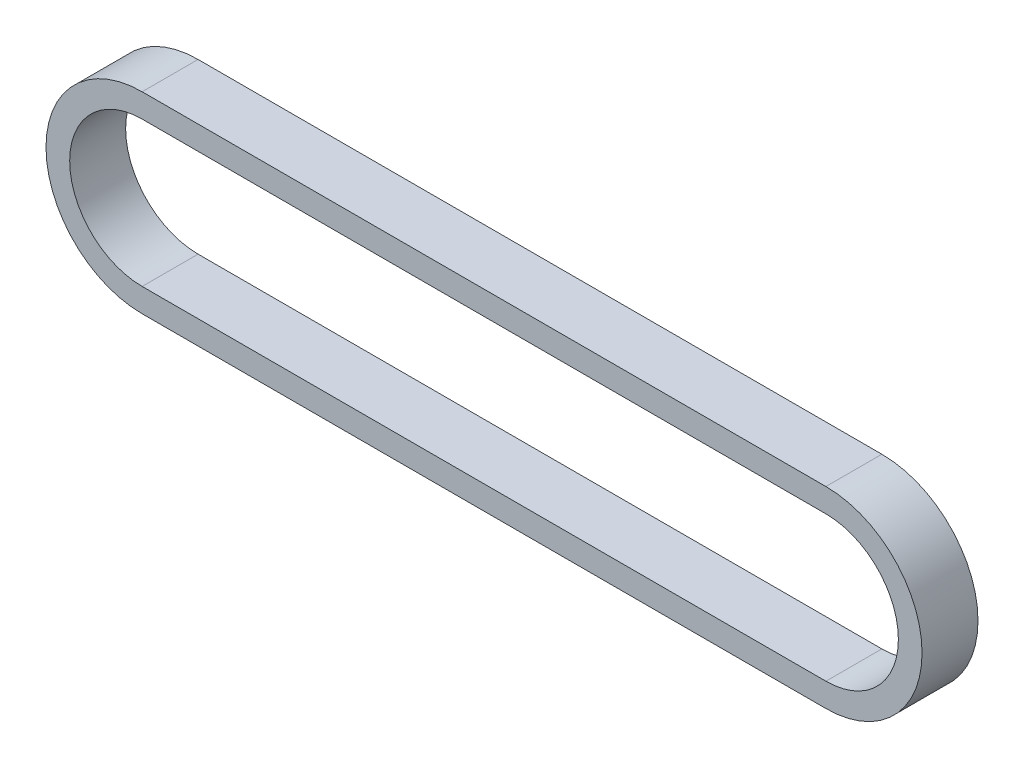
ISO-10303-21;
HEADER;
FILE_DESCRIPTION(('STEP AP214'),'2;1');
FILE_NAME('part.step','',(''),(''),'','','');
FILE_SCHEMA(('AUTOMOTIVE_DESIGN { 1 0 10303 214 1 1 1 1 }'));
ENDSEC;
DATA;
#1=APPLICATION_CONTEXT('core data for automotive mechanical design processes');
#2=APPLICATION_PROTOCOL_DEFINITION('international standard','automotive_design',2000,#1);
#3=PRODUCT_CONTEXT('',#1,'mechanical');
#4=PRODUCT('Part','Part','',(#3));
#5=PRODUCT_RELATED_PRODUCT_CATEGORY('part','',(#4));
#6=PRODUCT_DEFINITION_FORMATION('','',#4);
#7=PRODUCT_DEFINITION_CONTEXT('part definition',#1,'design');
#8=PRODUCT_DEFINITION('design','',#6,#7);
#9=PRODUCT_DEFINITION_SHAPE('','',#8);
#10=(LENGTH_UNIT() NAMED_UNIT(*) SI_UNIT(.MILLI.,.METRE.));
#11=(NAMED_UNIT(*) PLANE_ANGLE_UNIT() SI_UNIT($,.RADIAN.));
#12=(NAMED_UNIT(*) SI_UNIT($,.STERADIAN.) SOLID_ANGLE_UNIT());
#13=UNCERTAINTY_MEASURE_WITH_UNIT(LENGTH_MEASURE(1.E-05),#10,'distance_accuracy_value','');
#14=(GEOMETRIC_REPRESENTATION_CONTEXT(3) GLOBAL_UNCERTAINTY_ASSIGNED_CONTEXT((#13)) GLOBAL_UNIT_ASSIGNED_CONTEXT((#10,
#11,#12)) REPRESENTATION_CONTEXT('',''));
#15=CARTESIAN_POINT('',(0.,0.,0.));
#16=DIRECTION('',(0.,0.,1.));
#17=DIRECTION('',(1.,0.,0.));
#18=AXIS2_PLACEMENT_3D('',#15,#16,#17);
#19=CARTESIAN_POINT('',(0.,0.,4.5));
#20=DIRECTION('',(0.,0.,1.));
#21=DIRECTION('',(1.,0.,0.));
#22=AXIS2_PLACEMENT_3D('',#19,#20,#21);
#23=PLANE('',#22);
#24=CARTESIAN_POINT('',(0.,0.,4.5));
#25=DIRECTION('',(0.,0.,1.));
#26=DIRECTION('',(1.,0.,0.));
#27=AXIS2_PLACEMENT_3D('',#24,#25,#26);
#28=CIRCLE('',#27,15.4669567079091);
#29=CARTESIAN_POINT('',(0.,15.4669567079091,4.5));
#30=VERTEX_POINT('',#29);
#31=CARTESIAN_POINT('',(0.,-15.4669567079091,4.5));
#32=VERTEX_POINT('',#31);
#33=EDGE_CURVE('E157',#30,#32,#28,.T.);
#34=ORIENTED_EDGE('',*,*,#33,.T.);
#35=DIRECTION('',(1.,0.,0.));
#36=VECTOR('',#35,1.);
#37=CARTESIAN_POINT('',(0.,-15.4669567079091,4.5));
#38=LINE('',#37,#36);
#39=CARTESIAN_POINT('',(109.999999964,-15.4669567079091,4.5));
#40=VERTEX_POINT('',#39);
#41=EDGE_CURVE('E160',#32,#40,#38,.T.);
#42=ORIENTED_EDGE('',*,*,#41,.T.);
#43=CARTESIAN_POINT('',(109.999999964,0.,4.5));
#44=DIRECTION('',(0.,0.,1.));
#45=DIRECTION('',(1.,0.,0.));
#46=AXIS2_PLACEMENT_3D('',#43,#44,#45);
#47=CIRCLE('',#46,15.4669567079091);
#48=CARTESIAN_POINT('',(109.999999964,15.4669567079091,4.5));
#49=VERTEX_POINT('',#48);
#50=EDGE_CURVE('E163',#40,#49,#47,.T.);
#51=ORIENTED_EDGE('',*,*,#50,.T.);
#52=DIRECTION('',(-1.,0.,0.));
#53=VECTOR('',#52,1.);
#54=CARTESIAN_POINT('',(0.,15.4669567079091,4.5));
#55=LINE('',#54,#53);
#56=EDGE_CURVE('E165',#49,#30,#55,.T.);
#57=ORIENTED_EDGE('',*,*,#56,.T.);
#58=EDGE_LOOP('',(#34,#42,#51,#57));
#59=FACE_BOUND('',#58,.T.);
#60=DIRECTION('',(1.,0.,0.));
#61=VECTOR('',#60,1.);
#62=CARTESIAN_POINT('',(0.,-11.6569567079091,4.5));
#63=LINE('',#62,#61);
#64=CARTESIAN_POINT('',(0.,-11.6569567079091,4.5));
#65=VERTEX_POINT('',#64);
#66=CARTESIAN_POINT('',(109.999999964,-11.656956707909,4.5));
#67=VERTEX_POINT('',#66);
#68=EDGE_CURVE('E129',#65,#67,#63,.T.);
#69=ORIENTED_EDGE('',*,*,#68,.F.);
#70=CARTESIAN_POINT('',(0.,0.,4.5));
#71=DIRECTION('',(0.,0.,1.));
#72=DIRECTION('',(1.,0.,0.));
#73=AXIS2_PLACEMENT_3D('',#70,#71,#72);
#74=CIRCLE('',#73,11.6569567079091);
#75=CARTESIAN_POINT('',(0.,11.6569567079091,4.5));
#76=VERTEX_POINT('',#75);
#77=EDGE_CURVE('E121',#76,#65,#74,.T.);
#78=ORIENTED_EDGE('',*,*,#77,.F.);
#79=DIRECTION('',(-1.,0.,0.));
#80=VECTOR('',#79,1.);
#81=CARTESIAN_POINT('',(0.,11.6569567079091,4.5));
#82=LINE('',#81,#80);
#83=CARTESIAN_POINT('',(109.999999964,11.656956707909,4.5));
#84=VERTEX_POINT('',#83);
#85=EDGE_CURVE('E143',#84,#76,#82,.T.);
#86=ORIENTED_EDGE('',*,*,#85,.F.);
#87=CARTESIAN_POINT('',(109.999999964,0.,4.5));
#88=DIRECTION('',(0.,0.,1.));
#89=DIRECTION('',(1.,0.,0.));
#90=AXIS2_PLACEMENT_3D('',#87,#88,#89);
#91=CIRCLE('',#90,11.656956707909);
#92=EDGE_CURVE('E141',#67,#84,#91,.T.);
#93=ORIENTED_EDGE('',*,*,#92,.F.);
#94=EDGE_LOOP('',(#69,#78,#86,#93));
#95=FACE_BOUND('',#94,.T.);
#96=ADVANCED_FACE('F56',(#59,#95),#23,.T.);
#97=CARTESIAN_POINT('',(0.,0.,-4.5));
#98=DIRECTION('',(0.,0.,1.));
#99=DIRECTION('',(1.,0.,0.));
#100=AXIS2_PLACEMENT_3D('',#97,#98,#99);
#101=PLANE('',#100);
#102=CARTESIAN_POINT('',(0.,0.,-4.5));
#103=DIRECTION('',(0.,0.,1.));
#104=DIRECTION('',(1.,0.,0.));
#105=AXIS2_PLACEMENT_3D('',#102,#103,#104);
#106=CIRCLE('',#105,15.4669567079091);
#107=CARTESIAN_POINT('',(0.,15.4669567079091,-4.5));
#108=VERTEX_POINT('',#107);
#109=CARTESIAN_POINT('',(0.,-15.4669567079091,-4.5));
#110=VERTEX_POINT('',#109);
#111=EDGE_CURVE('E137',#108,#110,#106,.T.);
#112=ORIENTED_EDGE('',*,*,#111,.F.);
#113=DIRECTION('',(-1.,0.,0.));
#114=VECTOR('',#113,1.);
#115=CARTESIAN_POINT('',(0.,15.4669567079091,-4.5));
#116=LINE('',#115,#114);
#117=CARTESIAN_POINT('',(109.999999964,15.4669567079091,-4.5));
#118=VERTEX_POINT('',#117);
#119=EDGE_CURVE('E161',#118,#108,#116,.T.);
#120=ORIENTED_EDGE('',*,*,#119,.F.);
#121=CARTESIAN_POINT('',(109.999999964,0.,-4.5));
#122=DIRECTION('',(0.,0.,1.));
#123=DIRECTION('',(1.,0.,0.));
#124=AXIS2_PLACEMENT_3D('',#121,#122,#123);
#125=CIRCLE('',#124,15.4669567079091);
#126=CARTESIAN_POINT('',(109.999999964,-15.4669567079091,-4.5));
#127=VERTEX_POINT('',#126);
#128=EDGE_CURVE('E172',#127,#118,#125,.T.);
#129=ORIENTED_EDGE('',*,*,#128,.F.);
#130=DIRECTION('',(1.,0.,0.));
#131=VECTOR('',#130,1.);
#132=CARTESIAN_POINT('',(0.,-15.4669567079091,-4.5));
#133=LINE('',#132,#131);
#134=EDGE_CURVE('E170',#110,#127,#133,.T.);
#135=ORIENTED_EDGE('',*,*,#134,.F.);
#136=EDGE_LOOP('',(#112,#120,#129,#135));
#137=FACE_BOUND('',#136,.T.);
#138=CARTESIAN_POINT('',(0.,0.,-4.5));
#139=DIRECTION('',(0.,0.,1.));
#140=DIRECTION('',(1.,0.,0.));
#141=AXIS2_PLACEMENT_3D('',#138,#139,#140);
#142=CIRCLE('',#141,11.6569567079091);
#143=CARTESIAN_POINT('',(0.,11.6569567079091,-4.5));
#144=VERTEX_POINT('',#143);
#145=CARTESIAN_POINT('',(0.,-11.6569567079091,-4.5));
#146=VERTEX_POINT('',#145);
#147=EDGE_CURVE('E79',#144,#146,#142,.T.);
#148=ORIENTED_EDGE('',*,*,#147,.T.);
#149=DIRECTION('',(1.,0.,0.));
#150=VECTOR('',#149,1.);
#151=CARTESIAN_POINT('',(0.,-11.6569567079091,-4.5));
#152=LINE('',#151,#150);
#153=CARTESIAN_POINT('',(109.999999964,-11.656956707909,-4.5));
#154=VERTEX_POINT('',#153);
#155=EDGE_CURVE('E136',#146,#154,#152,.T.);
#156=ORIENTED_EDGE('',*,*,#155,.T.);
#157=CARTESIAN_POINT('',(109.999999964,0.,-4.5));
#158=DIRECTION('',(0.,0.,1.));
#159=DIRECTION('',(1.,0.,0.));
#160=AXIS2_PLACEMENT_3D('',#157,#158,#159);
#161=CIRCLE('',#160,11.656956707909);
#162=CARTESIAN_POINT('',(109.999999964,11.656956707909,-4.5));
#163=VERTEX_POINT('',#162);
#164=EDGE_CURVE('E149',#154,#163,#161,.T.);
#165=ORIENTED_EDGE('',*,*,#164,.T.);
#166=DIRECTION('',(-1.,0.,0.));
#167=VECTOR('',#166,1.);
#168=CARTESIAN_POINT('',(0.,11.6569567079091,-4.5));
#169=LINE('',#168,#167);
#170=EDGE_CURVE('E130',#163,#144,#169,.T.);
#171=ORIENTED_EDGE('',*,*,#170,.T.);
#172=EDGE_LOOP('',(#148,#156,#165,#171));
#173=FACE_BOUND('',#172,.T.);
#174=ADVANCED_FACE('F190',(#137,#173),#101,.F.);
#175=CARTESIAN_POINT('',(0.,0.,4.5));
#176=DIRECTION('',(0.,0.,-1.));
#177=DIRECTION('',(-1.,0.,0.));
#178=AXIS2_PLACEMENT_3D('',#175,#176,#177);
#179=CYLINDRICAL_SURFACE('',#178,15.4669567079091);
#180=ORIENTED_EDGE('',*,*,#111,.T.);
#181=DIRECTION('',(0.,0.,-1.));
#182=VECTOR('',#181,1.);
#183=CARTESIAN_POINT('',(0.,-15.4669567079091,4.5));
#184=LINE('',#183,#182);
#185=EDGE_CURVE('E12',#32,#110,#184,.T.);
#186=ORIENTED_EDGE('',*,*,#185,.F.);
#187=ORIENTED_EDGE('',*,*,#33,.F.);
#188=DIRECTION('',(0.,0.,-1.));
#189=VECTOR('',#188,1.);
#190=CARTESIAN_POINT('',(0.,15.4669567079091,4.5));
#191=LINE('',#190,#189);
#192=EDGE_CURVE('E167',#30,#108,#191,.T.);
#193=ORIENTED_EDGE('',*,*,#192,.T.);
#194=EDGE_LOOP('',(#180,#186,#187,#193));
#195=FACE_BOUND('',#194,.T.);
#196=ADVANCED_FACE('F58',(#195),#179,.T.);
#197=CARTESIAN_POINT('',(0.,-15.4669567079091,4.5));
#198=DIRECTION('',(0.,1.,0.));
#199=DIRECTION('',(-1.,0.,0.));
#200=AXIS2_PLACEMENT_3D('',#197,#198,#199);
#201=PLANE('',#200);
#202=ORIENTED_EDGE('',*,*,#134,.T.);
#203=DIRECTION('',(0.,0.,-1.));
#204=VECTOR('',#203,1.);
#205=CARTESIAN_POINT('',(109.999999964,-15.4669567079091,4.5));
#206=LINE('',#205,#204);
#207=EDGE_CURVE('E64',#40,#127,#206,.T.);
#208=ORIENTED_EDGE('',*,*,#207,.F.);
#209=ORIENTED_EDGE('',*,*,#41,.F.);
#210=ORIENTED_EDGE('',*,*,#185,.T.);
#211=EDGE_LOOP('',(#202,#208,#209,#210));
#212=FACE_BOUND('',#211,.T.);
#213=ADVANCED_FACE('F200',(#212),#201,.F.);
#214=CARTESIAN_POINT('',(109.999999964,0.,4.5));
#215=DIRECTION('',(0.,0.,-1.));
#216=DIRECTION('',(-1.,0.,0.));
#217=AXIS2_PLACEMENT_3D('',#214,#215,#216);
#218=CYLINDRICAL_SURFACE('',#217,15.4669567079091);
#219=ORIENTED_EDGE('',*,*,#128,.T.);
#220=DIRECTION('',(0.,0.,-1.));
#221=VECTOR('',#220,1.);
#222=CARTESIAN_POINT('',(109.999999964,15.4669567079091,4.5));
#223=LINE('',#222,#221);
#224=EDGE_CURVE('E177',#49,#118,#223,.T.);
#225=ORIENTED_EDGE('',*,*,#224,.F.);
#226=ORIENTED_EDGE('',*,*,#50,.F.);
#227=ORIENTED_EDGE('',*,*,#207,.T.);
#228=EDGE_LOOP('',(#219,#225,#226,#227));
#229=FACE_BOUND('',#228,.T.);
#230=ADVANCED_FACE('F184',(#229),#218,.T.);
#231=CARTESIAN_POINT('',(0.,15.4669567079091,4.5));
#232=DIRECTION('',(0.,-1.,0.));
#233=DIRECTION('',(1.,0.,0.));
#234=AXIS2_PLACEMENT_3D('',#231,#232,#233);
#235=PLANE('',#234);
#236=ORIENTED_EDGE('',*,*,#119,.T.);
#237=ORIENTED_EDGE('',*,*,#192,.F.);
#238=ORIENTED_EDGE('',*,*,#56,.F.);
#239=ORIENTED_EDGE('',*,*,#224,.T.);
#240=EDGE_LOOP('',(#236,#237,#238,#239));
#241=FACE_BOUND('',#240,.T.);
#242=ADVANCED_FACE('F194',(#241),#235,.F.);
#243=CARTESIAN_POINT('',(0.,0.,4.5));
#244=DIRECTION('',(0.,0.,-1.));
#245=DIRECTION('',(-1.,0.,0.));
#246=AXIS2_PLACEMENT_3D('',#243,#244,#245);
#247=CYLINDRICAL_SURFACE('',#246,11.6569567079091);
#248=ORIENTED_EDGE('',*,*,#147,.F.);
#249=DIRECTION('',(0.,0.,-1.));
#250=VECTOR('',#249,1.);
#251=CARTESIAN_POINT('',(0.,11.6569567079091,4.5));
#252=LINE('',#251,#250);
#253=EDGE_CURVE('E125',#76,#144,#252,.T.);
#254=ORIENTED_EDGE('',*,*,#253,.F.);
#255=ORIENTED_EDGE('',*,*,#77,.T.);
#256=DIRECTION('',(0.,0.,-1.));
#257=VECTOR('',#256,1.);
#258=CARTESIAN_POINT('',(0.,-11.6569567079091,4.5));
#259=LINE('',#258,#257);
#260=EDGE_CURVE('E124',#65,#146,#259,.T.);
#261=ORIENTED_EDGE('',*,*,#260,.T.);
#262=EDGE_LOOP('',(#248,#254,#255,#261));
#263=FACE_BOUND('',#262,.T.);
#264=ADVANCED_FACE('F123',(#263),#247,.F.);
#265=CARTESIAN_POINT('',(0.,-11.6569567079091,4.5));
#266=DIRECTION('',(0.,1.,0.));
#267=DIRECTION('',(-1.,0.,0.));
#268=AXIS2_PLACEMENT_3D('',#265,#266,#267);
#269=PLANE('',#268);
#270=ORIENTED_EDGE('',*,*,#155,.F.);
#271=ORIENTED_EDGE('',*,*,#260,.F.);
#272=ORIENTED_EDGE('',*,*,#68,.T.);
#273=DIRECTION('',(0.,0.,-1.));
#274=VECTOR('',#273,1.);
#275=CARTESIAN_POINT('',(109.999999964,-11.656956707909,4.5));
#276=LINE('',#275,#274);
#277=EDGE_CURVE('E138',#67,#154,#276,.T.);
#278=ORIENTED_EDGE('',*,*,#277,.T.);
#279=EDGE_LOOP('',(#270,#271,#272,#278));
#280=FACE_BOUND('',#279,.T.);
#281=ADVANCED_FACE('F133',(#280),#269,.T.);
#282=CARTESIAN_POINT('',(109.999999964,0.,4.5));
#283=DIRECTION('',(0.,0.,-1.));
#284=DIRECTION('',(-1.,0.,0.));
#285=AXIS2_PLACEMENT_3D('',#282,#283,#284);
#286=CYLINDRICAL_SURFACE('',#285,11.656956707909);
#287=ORIENTED_EDGE('',*,*,#164,.F.);
#288=ORIENTED_EDGE('',*,*,#277,.F.);
#289=ORIENTED_EDGE('',*,*,#92,.T.);
#290=DIRECTION('',(0.,0.,-1.));
#291=VECTOR('',#290,1.);
#292=CARTESIAN_POINT('',(109.999999964,11.656956707909,4.5));
#293=LINE('',#292,#291);
#294=EDGE_CURVE('E71',#84,#163,#293,.T.);
#295=ORIENTED_EDGE('',*,*,#294,.T.);
#296=EDGE_LOOP('',(#287,#288,#289,#295));
#297=FACE_BOUND('',#296,.T.);
#298=ADVANCED_FACE('F223',(#297),#286,.F.);
#299=CARTESIAN_POINT('',(0.,11.6569567079091,4.5));
#300=DIRECTION('',(0.,-1.,0.));
#301=DIRECTION('',(1.,0.,0.));
#302=AXIS2_PLACEMENT_3D('',#299,#300,#301);
#303=PLANE('',#302);
#304=ORIENTED_EDGE('',*,*,#170,.F.);
#305=ORIENTED_EDGE('',*,*,#294,.F.);
#306=ORIENTED_EDGE('',*,*,#85,.T.);
#307=ORIENTED_EDGE('',*,*,#253,.T.);
#308=EDGE_LOOP('',(#304,#305,#306,#307));
#309=FACE_BOUND('',#308,.T.);
#310=ADVANCED_FACE('F227',(#309),#303,.T.);
#311=CLOSED_SHELL('',(#96,#174,#196,#213,#230,#242,#264,#281,#298,#310));
#312=MANIFOLD_SOLID_BREP('B2',#311);
#313=ADVANCED_BREP_SHAPE_REPRESENTATION('',(#18,#312),#14);
#314=SHAPE_DEFINITION_REPRESENTATION(#9,#313);
ENDSEC;
END-ISO-10303-21;
